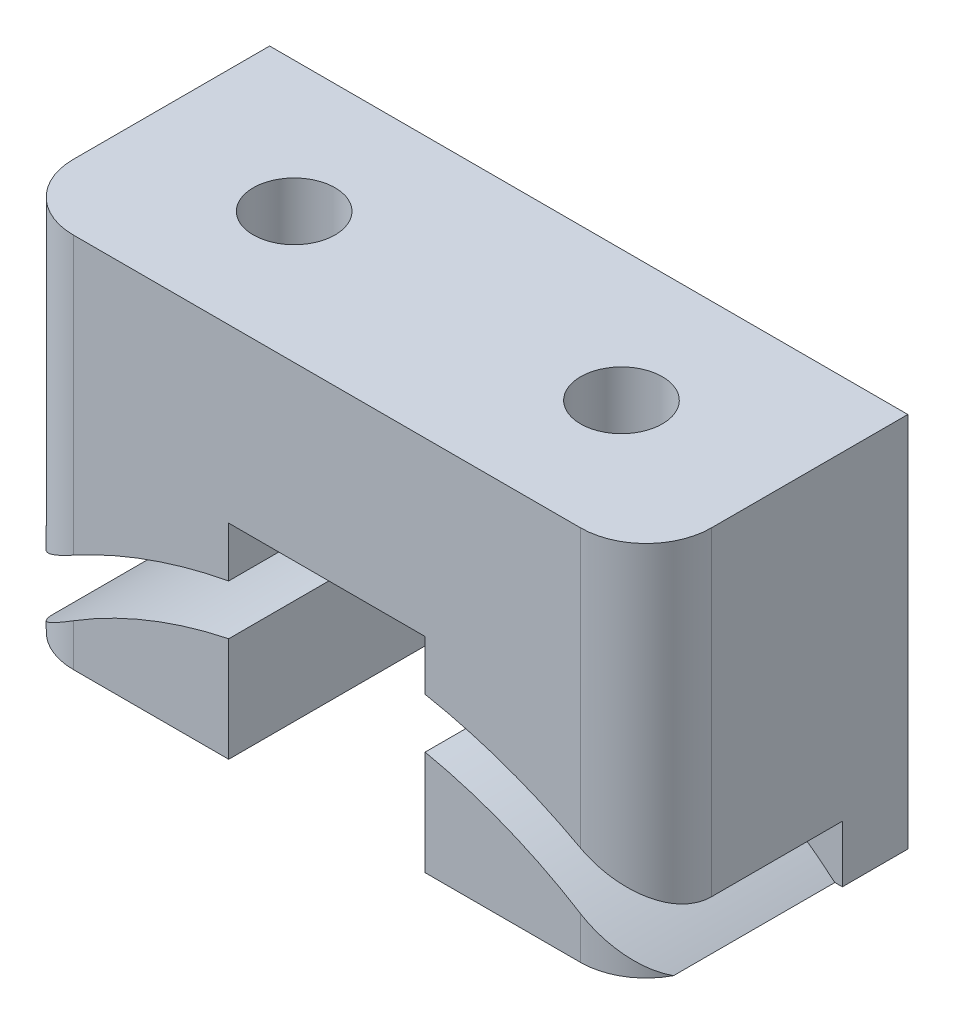
ISO-10303-21;
HEADER;
FILE_DESCRIPTION(('STEP AP214'),'2;1');
FILE_NAME('part.step','',(''),(''),'','','');
FILE_SCHEMA(('AUTOMOTIVE_DESIGN { 1 0 10303 214 1 1 1 1 }'));
ENDSEC;
DATA;
#1=APPLICATION_CONTEXT('core data for automotive mechanical design processes');
#2=APPLICATION_PROTOCOL_DEFINITION('international standard','automotive_design',2000,#1);
#3=PRODUCT_CONTEXT('',#1,'mechanical');
#4=PRODUCT('Part','Part','',(#3));
#5=PRODUCT_RELATED_PRODUCT_CATEGORY('part','',(#4));
#6=PRODUCT_DEFINITION_FORMATION('','',#4);
#7=PRODUCT_DEFINITION_CONTEXT('part definition',#1,'design');
#8=PRODUCT_DEFINITION('design','',#6,#7);
#9=PRODUCT_DEFINITION_SHAPE('','',#8);
#10=(LENGTH_UNIT() NAMED_UNIT(*) SI_UNIT(.MILLI.,.METRE.));
#11=(NAMED_UNIT(*) PLANE_ANGLE_UNIT() SI_UNIT($,.RADIAN.));
#12=(NAMED_UNIT(*) SI_UNIT($,.STERADIAN.) SOLID_ANGLE_UNIT());
#13=UNCERTAINTY_MEASURE_WITH_UNIT(LENGTH_MEASURE(1.E-05),#10,'distance_accuracy_value','');
#14=(GEOMETRIC_REPRESENTATION_CONTEXT(3) GLOBAL_UNCERTAINTY_ASSIGNED_CONTEXT((#13)) GLOBAL_UNIT_ASSIGNED_CONTEXT((#10,
#11,#12)) REPRESENTATION_CONTEXT('',''));
#15=CARTESIAN_POINT('',(0.,0.,0.));
#16=DIRECTION('',(0.,0.,1.));
#17=DIRECTION('',(1.,0.,0.));
#18=AXIS2_PLACEMENT_3D('',#15,#16,#17);
#19=CARTESIAN_POINT('',(-9.75,-5.,8.));
#20=DIRECTION('',(0.,1.,0.));
#21=DIRECTION('',(0.,0.,1.));
#22=AXIS2_PLACEMENT_3D('',#19,#20,#21);
#23=PLANE('',#22);
#24=DIRECTION('',(0.,0.,1.));
#25=VECTOR('',#24,1.);
#26=CARTESIAN_POINT('',(3.,-5.,8.));
#27=LINE('',#26,#25);
#28=CARTESIAN_POINT('',(3.,-5.,0.));
#29=VERTEX_POINT('',#28);
#30=CARTESIAN_POINT('',(3.,-5.,8.));
#31=VERTEX_POINT('',#30);
#32=EDGE_CURVE('E218',#29,#31,#27,.T.);
#33=ORIENTED_EDGE('',*,*,#32,.F.);
#34=DIRECTION('',(1.,0.,0.));
#35=VECTOR('',#34,1.);
#36=CARTESIAN_POINT('',(-9.75,-5.,0.));
#37=LINE('',#36,#35);
#38=CARTESIAN_POINT('',(9.75,-5.,0.));
#39=VERTEX_POINT('',#38);
#40=EDGE_CURVE('E285',#29,#39,#37,.T.);
#41=ORIENTED_EDGE('',*,*,#40,.T.);
#42=DIRECTION('',(0.,0.,-1.));
#43=VECTOR('',#42,1.);
#44=CARTESIAN_POINT('',(9.75,-5.,8.));
#45=LINE('',#44,#43);
#46=CARTESIAN_POINT('',(9.75,-5.,2.));
#47=VERTEX_POINT('',#46);
#48=EDGE_CURVE('E294',#47,#39,#45,.T.);
#49=ORIENTED_EDGE('',*,*,#48,.F.);
#50=DIRECTION('',(1.,0.,0.));
#51=VECTOR('',#50,1.);
#52=CARTESIAN_POINT('',(-9.75,-5.,2.));
#53=LINE('',#52,#51);
#54=CARTESIAN_POINT('',(9.52102935611481,-5.,2.));
#55=VERTEX_POINT('',#54);
#56=EDGE_CURVE('E428',#55,#47,#53,.T.);
#57=ORIENTED_EDGE('',*,*,#56,.F.);
#58=DIRECTION('',(0.,0.,1.));
#59=VECTOR('',#58,1.);
#60=CARTESIAN_POINT('',(9.52102935611481,-5.,2.));
#61=LINE('',#60,#59);
#62=CARTESIAN_POINT('',(9.52102935611481,-5.,6.92922280416462));
#63=VERTEX_POINT('',#62);
#64=EDGE_CURVE('E356',#63,#55,#61,.F.);
#65=ORIENTED_EDGE('',*,*,#64,.F.);
#66=CARTESIAN_POINT('',(7.75,-5.,6.));
#67=DIRECTION('',(0.,1.,0.));
#68=DIRECTION('',(0.,0.,1.));
#69=AXIS2_PLACEMENT_3D('',#66,#67,#68);
#70=CIRCLE('',#69,2.);
#71=CARTESIAN_POINT('',(7.75,-5.,8.));
#72=VERTEX_POINT('',#71);
#73=EDGE_CURVE('E311',#63,#72,#70,.F.);
#74=ORIENTED_EDGE('',*,*,#73,.T.);
#75=DIRECTION('',(1.,0.,0.));
#76=VECTOR('',#75,1.);
#77=CARTESIAN_POINT('',(-9.75,-5.,8.));
#78=LINE('',#77,#76);
#79=EDGE_CURVE('E288',#31,#72,#78,.T.);
#80=ORIENTED_EDGE('',*,*,#79,.F.);
#81=EDGE_LOOP('',(#33,#41,#49,#57,#65,#74,#80));
#82=FACE_BOUND('',#81,.T.);
#83=ADVANCED_FACE('F33',(#82),#23,.F.);
#84=CARTESIAN_POINT('',(0.,0.,8.));
#85=DIRECTION('',(0.,0.,-1.));
#86=DIRECTION('',(-1.,0.,0.));
#87=AXIS2_PLACEMENT_3D('',#84,#85,#86);
#88=PLANE('',#87);
#89=DIRECTION('',(0.,1.,0.));
#90=VECTOR('',#89,1.);
#91=CARTESIAN_POINT('',(3.,-11.25,8.));
#92=LINE('',#91,#90);
#93=CARTESIAN_POINT('',(3.,-1.80937805374625,8.));
#94=VERTEX_POINT('',#93);
#95=EDGE_CURVE('E182',#31,#94,#92,.T.);
#96=ORIENTED_EDGE('',*,*,#95,.F.);
#97=ORIENTED_EDGE('',*,*,#79,.T.);
#98=DIRECTION('',(0.,1.,0.));
#99=VECTOR('',#98,1.);
#100=CARTESIAN_POINT('',(7.75,0.,8.));
#101=LINE('',#100,#99);
#102=CARTESIAN_POINT('',(7.75,-3.70890317065791,8.));
#103=VERTEX_POINT('',#102);
#104=EDGE_CURVE('E304',#72,#103,#101,.T.);
#105=ORIENTED_EDGE('',*,*,#104,.T.);
#106=CARTESIAN_POINT('',(0.,-16.2,8.));
#107=DIRECTION('',(0.,0.,1.));
#108=DIRECTION('',(1.,0.,0.));
#109=AXIS2_PLACEMENT_3D('',#106,#107,#108);
#110=CIRCLE('',#109,14.7);
#111=EDGE_CURVE('E56',#103,#94,#110,.T.);
#112=ORIENTED_EDGE('',*,*,#111,.T.);
#113=EDGE_LOOP('',(#96,#97,#105,#112));
#114=FACE_BOUND('',#113,.T.);
#115=ADVANCED_FACE('F246',(#114),#88,.F.);
#116=CARTESIAN_POINT('',(3.,-0.280201006294081,8.));
#117=VERTEX_POINT('',#116);
#118=CARTESIAN_POINT('',(3.,1.25,8.));
#119=VERTEX_POINT('',#118);
#120=EDGE_CURVE('E171',#117,#119,#92,.T.);
#121=ORIENTED_EDGE('',*,*,#120,.F.);
#122=CARTESIAN_POINT('',(0.,-16.2,8.));
#123=DIRECTION('',(0.,0.,1.));
#124=DIRECTION('',(1.,0.,0.));
#125=AXIS2_PLACEMENT_3D('',#122,#123,#124);
#126=CIRCLE('',#125,16.2);
#127=CARTESIAN_POINT('',(7.75,-1.97405539164446,8.));
#128=VERTEX_POINT('',#127);
#129=EDGE_CURVE('E447',#128,#117,#126,.T.);
#130=ORIENTED_EDGE('',*,*,#129,.F.);
#131=CARTESIAN_POINT('',(7.75,6.5,8.));
#132=VERTEX_POINT('',#131);
#133=EDGE_CURVE('E303',#128,#132,#101,.T.);
#134=ORIENTED_EDGE('',*,*,#133,.T.);
#135=DIRECTION('',(-1.,0.,0.));
#136=VECTOR('',#135,1.);
#137=CARTESIAN_POINT('',(-9.75,6.5,8.));
#138=LINE('',#137,#136);
#139=CARTESIAN_POINT('',(-7.75,6.5,8.));
#140=VERTEX_POINT('',#139);
#141=EDGE_CURVE('E284',#132,#140,#138,.T.);
#142=ORIENTED_EDGE('',*,*,#141,.T.);
#143=DIRECTION('',(0.,-1.,0.));
#144=VECTOR('',#143,1.);
#145=CARTESIAN_POINT('',(-7.75,0.,8.));
#146=LINE('',#145,#144);
#147=CARTESIAN_POINT('',(-7.75,-1.97405539164446,8.));
#148=VERTEX_POINT('',#147);
#149=EDGE_CURVE('E308',#140,#148,#146,.T.);
#150=ORIENTED_EDGE('',*,*,#149,.T.);
#151=CARTESIAN_POINT('',(-3.,-0.280201006294081,8.));
#152=VERTEX_POINT('',#151);
#153=EDGE_CURVE('E421',#152,#148,#126,.T.);
#154=ORIENTED_EDGE('',*,*,#153,.F.);
#155=DIRECTION('',(0.,1.,0.));
#156=VECTOR('',#155,1.);
#157=CARTESIAN_POINT('',(-3.,-11.25,8.));
#158=LINE('',#157,#156);
#159=CARTESIAN_POINT('',(-3.,1.25,8.));
#160=VERTEX_POINT('',#159);
#161=EDGE_CURVE('E197',#152,#160,#158,.T.);
#162=ORIENTED_EDGE('',*,*,#161,.T.);
#163=DIRECTION('',(-1.,0.,0.));
#164=VECTOR('',#163,1.);
#165=CARTESIAN_POINT('',(3.,1.25,8.));
#166=LINE('',#165,#164);
#167=EDGE_CURVE('E188',#119,#160,#166,.T.);
#168=ORIENTED_EDGE('',*,*,#167,.F.);
#169=EDGE_LOOP('',(#121,#130,#134,#142,#150,#154,#162,#168));
#170=FACE_BOUND('',#169,.T.);
#171=ADVANCED_FACE('F195',(#170),#88,.F.);
#172=CARTESIAN_POINT('',(0.,0.,0.));
#173=DIRECTION('',(0.,0.,-1.));
#174=DIRECTION('',(-1.,0.,0.));
#175=AXIS2_PLACEMENT_3D('',#172,#173,#174);
#176=PLANE('',#175);
#177=ORIENTED_EDGE('',*,*,#40,.F.);
#178=DIRECTION('',(0.,1.,0.));
#179=VECTOR('',#178,1.);
#180=CARTESIAN_POINT('',(3.,-11.25,0.));
#181=LINE('',#180,#179);
#182=CARTESIAN_POINT('',(3.,1.25,0.));
#183=VERTEX_POINT('',#182);
#184=EDGE_CURVE('E202',#29,#183,#181,.T.);
#185=ORIENTED_EDGE('',*,*,#184,.T.);
#186=DIRECTION('',(-1.,0.,0.));
#187=VECTOR('',#186,1.);
#188=CARTESIAN_POINT('',(3.,1.25,0.));
#189=LINE('',#188,#187);
#190=CARTESIAN_POINT('',(-3.,1.25,0.));
#191=VERTEX_POINT('',#190);
#192=EDGE_CURVE('E191',#183,#191,#189,.T.);
#193=ORIENTED_EDGE('',*,*,#192,.T.);
#194=DIRECTION('',(0.,1.,0.));
#195=VECTOR('',#194,1.);
#196=CARTESIAN_POINT('',(-3.,-11.25,0.));
#197=LINE('',#196,#195);
#198=CARTESIAN_POINT('',(-3.,-5.,0.));
#199=VERTEX_POINT('',#198);
#200=EDGE_CURVE('E183',#199,#191,#197,.T.);
#201=ORIENTED_EDGE('',*,*,#200,.F.);
#202=CARTESIAN_POINT('',(-9.75,-5.,0.));
#203=VERTEX_POINT('',#202);
#204=EDGE_CURVE('E274',#203,#199,#37,.T.);
#205=ORIENTED_EDGE('',*,*,#204,.F.);
#206=DIRECTION('',(0.,-1.,0.));
#207=VECTOR('',#206,1.);
#208=CARTESIAN_POINT('',(-9.75,-5.,0.));
#209=LINE('',#208,#207);
#210=CARTESIAN_POINT('',(-9.75,6.5,0.));
#211=VERTEX_POINT('',#210);
#212=EDGE_CURVE('E290',#211,#203,#209,.T.);
#213=ORIENTED_EDGE('',*,*,#212,.F.);
#214=DIRECTION('',(-1.,0.,0.));
#215=VECTOR('',#214,1.);
#216=CARTESIAN_POINT('',(-9.75,6.5,0.));
#217=LINE('',#216,#215);
#218=CARTESIAN_POINT('',(9.75,6.5,0.));
#219=VERTEX_POINT('',#218);
#220=EDGE_CURVE('E409',#219,#211,#217,.T.);
#221=ORIENTED_EDGE('',*,*,#220,.F.);
#222=DIRECTION('',(0.,1.,0.));
#223=VECTOR('',#222,1.);
#224=CARTESIAN_POINT('',(9.75,-5.,0.));
#225=LINE('',#224,#223);
#226=EDGE_CURVE('E393',#39,#219,#225,.T.);
#227=ORIENTED_EDGE('',*,*,#226,.F.);
#228=EDGE_LOOP('',(#177,#185,#193,#201,#205,#213,#221,#227));
#229=FACE_BOUND('',#228,.T.);
#230=ADVANCED_FACE('F381',(#229),#176,.T.);
#231=CARTESIAN_POINT('',(0.,-16.2,2.));
#232=DIRECTION('',(0.,0.,1.));
#233=DIRECTION('',(1.,0.,0.));
#234=AXIS2_PLACEMENT_3D('',#231,#232,#233);
#235=PLANE('',#234);
#236=CARTESIAN_POINT('',(0.,-16.2,2.));
#237=DIRECTION('',(0.,0.,1.));
#238=DIRECTION('',(1.,0.,0.));
#239=AXIS2_PLACEMENT_3D('',#236,#237,#238);
#240=CIRCLE('',#239,16.2);
#241=CARTESIAN_POINT('',(9.75,-3.26255434794024,2.));
#242=VERTEX_POINT('',#241);
#243=CARTESIAN_POINT('',(3.,-0.280201006294081,2.));
#244=VERTEX_POINT('',#243);
#245=EDGE_CURVE('E445',#242,#244,#240,.T.);
#246=ORIENTED_EDGE('',*,*,#245,.T.);
#247=DIRECTION('',(0.,-1.,0.));
#248=VECTOR('',#247,1.);
#249=CARTESIAN_POINT('',(3.,-16.2,2.));
#250=LINE('',#249,#248);
#251=CARTESIAN_POINT('',(3.,-1.80937805374625,2.));
#252=VERTEX_POINT('',#251);
#253=EDGE_CURVE('E214',#244,#252,#250,.T.);
#254=ORIENTED_EDGE('',*,*,#253,.T.);
#255=CARTESIAN_POINT('',(0.,-16.2,2.));
#256=DIRECTION('',(0.,0.,1.));
#257=DIRECTION('',(1.,0.,0.));
#258=AXIS2_PLACEMENT_3D('',#255,#256,#257);
#259=CIRCLE('',#258,14.7);
#260=EDGE_CURVE('E444',#55,#252,#259,.T.);
#261=ORIENTED_EDGE('',*,*,#260,.F.);
#262=ORIENTED_EDGE('',*,*,#56,.T.);
#263=DIRECTION('',(0.,1.,0.));
#264=VECTOR('',#263,1.);
#265=CARTESIAN_POINT('',(9.75,-5.,2.));
#266=LINE('',#265,#264);
#267=EDGE_CURVE('E401',#47,#242,#266,.T.);
#268=ORIENTED_EDGE('',*,*,#267,.T.);
#269=EDGE_LOOP('',(#246,#254,#261,#262,#268));
#270=FACE_BOUND('',#269,.T.);
#271=ADVANCED_FACE('F383',(#270),#235,.T.);
#272=CARTESIAN_POINT('',(0.,-16.2,2.));
#273=DIRECTION('',(0.,0.,1.));
#274=DIRECTION('',(1.,0.,0.));
#275=AXIS2_PLACEMENT_3D('',#272,#273,#274);
#276=CYLINDRICAL_SURFACE('',#275,16.2);
#277=CARTESIAN_POINT('',(5.,-0.790911772593422,5.25));
#278=CARTESIAN_POINT('',(4.92832752241009,-0.767655915310068,5.24999741711892));
#279=CARTESIAN_POINT('',(4.85644760344739,-0.744889599337321,5.24382079121709));
#280=CARTESIAN_POINT('',(4.71429839763982,-0.700937483207522,5.21905172153236));
#281=CARTESIAN_POINT('',(4.64403063024637,-0.67975313481902,5.20044802541624));
#282=CARTESIAN_POINT('',(4.50716041966972,-0.639453722545459,5.15104583331516));
#283=CARTESIAN_POINT('',(4.44056265023773,-0.620341268587926,5.12023217887717));
#284=CARTESIAN_POINT('',(4.31330730343238,-0.584630909141602,5.0470610429256));
#285=CARTESIAN_POINT('',(4.25264777507901,-0.568032176794917,5.00470737024747));
#286=CARTESIAN_POINT('',(4.14113720626484,-0.538128548356296,4.91103757212503));
#287=CARTESIAN_POINT('',(4.09003762687463,-0.524736456258344,4.86004532528484));
#288=CARTESIAN_POINT('',(3.99712318079939,-0.500786176318442,4.74962738220938));
#289=CARTESIAN_POINT('',(3.95530673948906,-0.490227507801719,4.69020311903767));
#290=CARTESIAN_POINT('',(3.8837602641599,-0.472389810425092,4.56692663900732));
#291=CARTESIAN_POINT('',(3.85365061066989,-0.465006758624082,4.50330960002847));
#292=CARTESIAN_POINT('',(3.80447660516294,-0.453044642951162,4.37169432186705));
#293=CARTESIAN_POINT('',(3.78541068968811,-0.448465182170686,4.30369670435669));
#294=CARTESIAN_POINT('',(3.75927301986029,-0.442206869586319,4.16686067820164));
#295=CARTESIAN_POINT('',(3.75194706224651,-0.440466527397886,4.09807352662042));
#296=CARTESIAN_POINT('',(3.74873264284202,-0.439701557263308,3.96021938511541));
#297=CARTESIAN_POINT('',(3.75284342582668,-0.440676749996946,3.89115241397024));
#298=CARTESIAN_POINT('',(3.77228682930195,-0.44531978032452,3.7552658729158));
#299=CARTESIAN_POINT('',(3.78753138586014,-0.44896648793731,3.68843294596633));
#300=CARTESIAN_POINT('',(3.82864122272979,-0.458908864712245,3.55832939700728));
#301=CARTESIAN_POINT('',(3.85450646216059,-0.465204523678168,3.49505876128696));
#302=CARTESIAN_POINT('',(3.91617103005992,-0.480438523954785,3.37351679714506));
#303=CARTESIAN_POINT('',(3.95201825746357,-0.48938962137151,3.31527139329856));
#304=CARTESIAN_POINT('',(4.03244495733429,-0.509840528566483,3.20567097847126));
#305=CARTESIAN_POINT('',(4.07702494345059,-0.521340488270648,3.15431637309757));
#306=CARTESIAN_POINT('',(4.1744058645665,-0.546984002750375,3.05892476306311));
#307=CARTESIAN_POINT('',(4.22733986590104,-0.561171258947605,3.01503546789167));
#308=CARTESIAN_POINT('',(4.33920907226946,-0.591841057573526,2.93674138657054));
#309=CARTESIAN_POINT('',(4.3981450694608,-0.60832390308526,2.90233785460134));
#310=CARTESIAN_POINT('',(4.52223389696362,-0.643853658003757,2.84279565535211));
#311=CARTESIAN_POINT('',(4.58752358228262,-0.662964678858992,2.81798071538352));
#312=CARTESIAN_POINT('',(4.7208120951992,-0.702942988414325,2.77960373643822));
#313=CARTESIAN_POINT('',(4.78881145340094,-0.723810621990586,2.76604391288292));
#314=CARTESIAN_POINT('',(4.92844315592116,-0.767695873922897,2.74999503049249));
#315=CARTESIAN_POINT('',(5.00011224196507,-0.79076604402298,2.74796900285824));
#316=CARTESIAN_POINT('',(5.14249715464828,-0.837697195037619,2.75610179917648));
#317=CARTESIAN_POINT('',(5.2132127706691,-0.861558346778223,2.76626327211999));
#318=CARTESIAN_POINT('',(5.35418162770589,-0.910183760960313,2.79897407448934));
#319=CARTESIAN_POINT('',(5.42434067424899,-0.934951586906989,2.82192551459416));
#320=CARTESIAN_POINT('',(5.5597654452518,-0.983752299623215,2.87991540783506));
#321=CARTESIAN_POINT('',(5.62503053118404,-1.00778509024947,2.91495543487096));
#322=CARTESIAN_POINT('',(5.74894781616147,-1.05424173074427,2.99646046564042));
#323=CARTESIAN_POINT('',(5.80758082434799,-1.07666084640809,3.04295744695464));
#324=CARTESIAN_POINT('',(5.91610514278848,-1.11878341538606,3.1462673907349));
#325=CARTESIAN_POINT('',(5.96599835120182,-1.1384874581763,3.20307810773345));
#326=CARTESIAN_POINT('',(6.05318414517263,-1.17332123846359,3.32284140291231));
#327=CARTESIAN_POINT('',(6.090937265068,-1.18861503226053,3.38541007591244));
#328=CARTESIAN_POINT('',(6.1551946648594,-1.21484762152312,3.5169144883316));
#329=CARTESIAN_POINT('',(6.18170528384051,-1.22578887095515,3.58584661294552));
#330=CARTESIAN_POINT('',(6.22076305364249,-1.2419746376442,3.72265150156184));
#331=CARTESIAN_POINT('',(6.23419276477959,-1.24757853900921,3.79023022431834));
#332=CARTESIAN_POINT('',(6.24975168043044,-1.25407483244132,3.92689171623083));
#333=CARTESIAN_POINT('',(6.25188498162125,-1.25496893253141,3.99597393101353));
#334=CARTESIAN_POINT('',(6.24494773512751,-1.25206914400475,4.12987766507543));
#335=CARTESIAN_POINT('',(6.23644961302328,-1.24851476957946,4.19473510409048));
#336=CARTESIAN_POINT('',(6.20956576209259,-1.23732969671022,4.32199382360901));
#337=CARTESIAN_POINT('',(6.19118005921745,-1.22969900896511,4.38439511055854));
#338=CARTESIAN_POINT('',(6.14506926113926,-1.21071233114488,4.50551461555124));
#339=CARTESIAN_POINT('',(6.11728226313467,-1.19933166264306,4.56420527917721));
#340=CARTESIAN_POINT('',(6.05336290860589,-1.17342410637939,4.67607676108062));
#341=CARTESIAN_POINT('',(6.01722900994027,-1.15889663725761,4.72925655855815));
#342=CARTESIAN_POINT('',(5.93545321615522,-1.12643263749681,4.83184724934929));
#343=CARTESIAN_POINT('',(5.88938917412323,-1.10834977456257,4.88087490690233));
#344=CARTESIAN_POINT('',(5.79049004459535,-1.07012773840221,4.97061255305657));
#345=CARTESIAN_POINT('',(5.7376512871444,-1.04998745185274,5.01131800216455));
#346=CARTESIAN_POINT('',(5.62265193317097,-1.00691568013154,5.08620360939894));
#347=CARTESIAN_POINT('',(5.5600969481718,-0.983887513257275,5.11972258998934));
#348=CARTESIAN_POINT('',(5.43049411461728,-0.937154038182828,5.17564869868763));
#349=CARTESIAN_POINT('',(5.36344981551251,-0.913449273244165,5.19806449041203));
#350=CARTESIAN_POINT('',(5.24683709406694,-0.873118031730059,5.22639034920834));
#351=CARTESIAN_POINT('',(5.19796458864748,-0.856471615238173,5.23522134372731));
#352=CARTESIAN_POINT('',(5.09942807303349,-0.823442050715136,5.24702715406857));
#353=CARTESIAN_POINT('',(5.0497640390251,-0.807058910634787,5.25000179336057));
#354=CARTESIAN_POINT('',(5.,-0.790911772593422,5.25));
#355=B_SPLINE_CURVE_WITH_KNOTS('',3,(#277,#278,#279,#280,#281,#282,#283,#284,#285,#286,#287,
#288,#289,#290,#291,#292,#293,#294,#295,#296,#297,#298,#299,#300,#301,#302,#303,#304,#305,#306,
#307,#308,#309,#310,#311,#312,#313,#314,#315,#316,#317,#318,#319,#320,#321,#322,#323,#324,#325,
#326,#327,#328,#329,#330,#331,#332,#333,#334,#335,#336,#337,#338,#339,#340,#341,#342,#343,#344,
#345,#346,#347,#348,#349,#350,#351,#352,#353,#354),.UNSPECIFIED.,.T.,.F.,(4,2,2,2,2,2,2,2,2,2,2,
2,2,2,2,2,2,2,2,2,2,2,2,2,2,2,2,2,2,2,2,2,2,2,2,2,2,2,4),(0.,0.225871057128809,
0.451946911344288,0.678304318642068,0.904587105960695,1.12375101593039,1.34287772240657,
1.55414716432867,1.76538668959977,1.97198728394147,2.17857423574636,2.38354461997685,
2.58851421525196,2.79448483586868,3.00046757504255,3.21014347629524,3.4198470870168,
3.63611501303466,3.85242549845649,4.07736179393614,4.30234698887784,4.53484077146698,
4.76736483551962,5.00054540027062,5.2336752585811,5.4564705754654,5.67914010162261,
5.88545530772704,6.09169568787419,6.28729430811593,6.4828924149844,6.67980434639967,
6.876752687649,7.08483927131237,7.29303905835984,7.51589703332915,7.73858084125938,
7.89540418092543,8.05223224770319),.UNSPECIFIED.);
#356=CARTESIAN_POINT('',(5.,-0.790911772593422,5.25));
#357=VERTEX_POINT('',#356);
#358=EDGE_CURVE('E438',#357,#357,#355,.T.);
#359=ORIENTED_EDGE('',*,*,#358,.F.);
#360=EDGE_LOOP('',(#359));
#361=FACE_BOUND('',#360,.T.);
#362=DIRECTION('',(0.,0.,1.));
#363=VECTOR('',#362,1.);
#364=CARTESIAN_POINT('',(3.,-0.280201006294081,2.));
#365=LINE('',#364,#363);
#366=EDGE_CURVE('E177',#244,#117,#365,.T.);
#367=ORIENTED_EDGE('',*,*,#366,.F.);
#368=ORIENTED_EDGE('',*,*,#245,.F.);
#369=DIRECTION('',(0.,0.,1.));
#370=VECTOR('',#369,1.);
#371=CARTESIAN_POINT('',(9.75,-3.26255434794024,2.));
#372=LINE('',#371,#370);
#373=CARTESIAN_POINT('',(9.75,-3.26255434794024,6.));
#374=VERTEX_POINT('',#373);
#375=EDGE_CURVE('E375',#374,#242,#372,.F.);
#376=ORIENTED_EDGE('',*,*,#375,.F.);
#377=CARTESIAN_POINT('',(9.75,-3.26255434794024,6.));
#378=CARTESIAN_POINT('',(9.75001021150017,-3.26256440844748,6.04877362287299));
#379=CARTESIAN_POINT('',(9.74821618675418,-3.26121007021725,6.09753975509917));
#380=CARTESIAN_POINT('',(9.74109850605592,-3.25584935466432,6.1946387784566));
#381=CARTESIAN_POINT('',(9.7357769514086,-3.25184455618953,6.24297191015915));
#382=CARTESIAN_POINT('',(9.72172848404995,-3.24129376024212,6.33853544039022));
#383=CARTESIAN_POINT('',(9.71302383130515,-3.23476437535607,6.38577095095691));
#384=CARTESIAN_POINT('',(9.69235400541125,-3.21930509558161,6.47911282919326));
#385=CARTESIAN_POINT('',(9.68038850309134,-3.21037495834729,6.52521908235613));
#386=CARTESIAN_POINT('',(9.63990505374658,-3.18027009660137,6.66118565532076));
#387=CARTESIAN_POINT('',(9.60675618247775,-3.1557474418587,6.74898381473651));
#388=CARTESIAN_POINT('',(9.52969810972085,-3.09934641778879,6.91720953598377));
#389=CARTESIAN_POINT('',(9.4857722452569,-3.06745666223306,6.9976254164794));
#390=CARTESIAN_POINT('',(9.38472349736279,-2.99503370378951,7.15639754756111));
#391=CARTESIAN_POINT('',(9.32680259889006,-2.9539998008351,7.23401496153122));
#392=CARTESIAN_POINT('',(9.20209804695968,-2.86706416169659,7.37860075587701));
#393=CARTESIAN_POINT('',(9.13531189452086,-2.82116105369277,7.4455661218573));
#394=CARTESIAN_POINT('',(8.98077367706315,-2.71682668085722,7.58039160873183));
#395=CARTESIAN_POINT('',(8.8914640034554,-2.65768850618155,7.64592436142239));
#396=CARTESIAN_POINT('',(8.70459817817457,-2.53682315439183,7.76091044329486));
#397=CARTESIAN_POINT('',(8.60703445777297,-2.47509362778799,7.81034880855269));
#398=CARTESIAN_POINT('',(8.38685949987888,-2.33925758669821,7.90026807496042));
#399=CARTESIAN_POINT('',(8.26295552223399,-2.26497585091898,7.93739505866572));
#400=CARTESIAN_POINT('',(8.07307188356609,-2.15468342144274,7.97479057437902));
#401=CARTESIAN_POINT('',(8.00909046879273,-2.11809913231847,7.98420664771235));
#402=CARTESIAN_POINT('',(7.88016951631475,-2.0455516503008,7.99680787937594));
#403=CARTESIAN_POINT('',(7.81522996690803,-2.00958846500487,7.99999296154101));
#404=CARTESIAN_POINT('',(7.75,-1.97405539164446,8.));
#405=B_SPLINE_CURVE_WITH_KNOTS('',3,(#377,#378,#379,#380,#381,#382,#383,#384,#385,#386,#387,
#388,#389,#390,#391,#392,#393,#394,#395,#396,#397,#398,#399,#400,#401,#402,#403,#404),
.UNSPECIFIED.,.F.,.F.,(4,2,2,2,2,2,2,2,2,2,2,2,2,4),(0.,0.146256814789248,0.292426584442138,
0.437650444894884,0.582888970597264,0.87249175508307,1.16254516584873,1.47693348704952,
1.79141061851217,2.16665315977221,2.54224359682794,2.98738383230616,3.21005917568093,
3.43273724093421),.UNSPECIFIED.);
#406=EDGE_CURVE('E331',#374,#128,#405,.T.);
#407=ORIENTED_EDGE('',*,*,#406,.T.);
#408=ORIENTED_EDGE('',*,*,#129,.T.);
#409=EDGE_LOOP('',(#367,#368,#376,#407,#408));
#410=FACE_BOUND('',#409,.T.);
#411=ADVANCED_FACE('F269',(#361,#410),#276,.F.);
#412=CARTESIAN_POINT('',(0.,-16.2,2.));
#413=DIRECTION('',(0.,0.,1.));
#414=DIRECTION('',(1.,0.,0.));
#415=AXIS2_PLACEMENT_3D('',#412,#413,#414);
#416=CYLINDRICAL_SURFACE('',#415,14.7);
#417=ORIENTED_EDGE('',*,*,#260,.T.);
#418=DIRECTION('',(0.,0.,1.));
#419=VECTOR('',#418,1.);
#420=CARTESIAN_POINT('',(3.,-1.80937805374625,2.));
#421=LINE('',#420,#419);
#422=EDGE_CURVE('E11',#252,#94,#421,.T.);
#423=ORIENTED_EDGE('',*,*,#422,.T.);
#424=ORIENTED_EDGE('',*,*,#111,.F.);
#425=CARTESIAN_POINT('',(9.52102935611481,-5.,6.92922280416462));
#426=CARTESIAN_POINT('',(9.49261136295136,-4.9758409081193,6.98337471711131));
#427=CARTESIAN_POINT('',(9.46205463451771,-4.95005255760685,7.03558829326773));
#428=CARTESIAN_POINT('',(9.39714636156302,-4.89577847505668,7.13599377143114));
#429=CARTESIAN_POINT('',(9.36280016341099,-4.8672965511522,7.18419117520801));
#430=CARTESIAN_POINT('',(9.2551740761095,-4.77895408910065,7.32211548037069));
#431=CARTESIAN_POINT('',(9.17689793179396,-4.71584522049557,7.40593104756799));
#432=CARTESIAN_POINT('',(9.01044731882262,-4.58479390305946,7.55686758763356));
#433=CARTESIAN_POINT('',(8.92233185750779,-4.51688107853198,7.62408106025901));
#434=CARTESIAN_POINT('',(8.73763921195156,-4.37811047389455,7.74259758489486));
#435=CARTESIAN_POINT('',(8.64103707119306,-4.3072443536633,7.79385155086108));
#436=CARTESIAN_POINT('',(8.41685377246877,-4.14720883175949,7.89039482585941));
#437=CARTESIAN_POINT('',(8.28746337783901,-4.05779084097009,7.93118048825178));
#438=CARTESIAN_POINT('',(8.08871753873053,-3.92526892878545,7.97226704359235));
#439=CARTESIAN_POINT('',(8.02177975445686,-3.881416888061,7.98261346211632));
#440=CARTESIAN_POINT('',(7.88669618541092,-3.79449782508579,7.99647530392692));
#441=CARTESIAN_POINT('',(7.8185503465869,-3.75143083813629,7.99999042077954));
#442=CARTESIAN_POINT('',(7.75,-3.70890317065791,8.));
#443=B_SPLINE_CURVE_WITH_KNOTS('',3,(#425,#426,#427,#428,#429,#430,#431,#432,#433,#434,#435,
#436,#437,#438,#439,#440,#441,#442),.UNSPECIFIED.,.F.,.F.,(4,2,2,2,2,2,2,2,4),(0.,
0.197060594541268,0.393846638144657,0.784671426576186,1.17326693098939,1.56304608036927,
2.04789124876014,2.28970332226517,2.53152624256631),.UNSPECIFIED.);
#444=EDGE_CURVE('E326',#63,#103,#443,.T.);
#445=ORIENTED_EDGE('',*,*,#444,.F.);
#446=ORIENTED_EDGE('',*,*,#64,.T.);
#447=EDGE_LOOP('',(#417,#423,#424,#445,#446));
#448=FACE_BOUND('',#447,.T.);
#449=ADVANCED_FACE('F261',(#448),#416,.T.);
#450=ORIENTED_EDGE('',*,*,#204,.T.);
#451=DIRECTION('',(0.,0.,1.));
#452=VECTOR('',#451,1.);
#453=CARTESIAN_POINT('',(-3.,-5.,8.));
#454=LINE('',#453,#452);
#455=CARTESIAN_POINT('',(-3.,-5.,8.));
#456=VERTEX_POINT('',#455);
#457=EDGE_CURVE('E211',#199,#456,#454,.T.);
#458=ORIENTED_EDGE('',*,*,#457,.T.);
#459=CARTESIAN_POINT('',(-7.75,-5.,8.));
#460=VERTEX_POINT('',#459);
#461=EDGE_CURVE('E297',#460,#456,#78,.T.);
#462=ORIENTED_EDGE('',*,*,#461,.F.);
#463=CARTESIAN_POINT('',(-7.75,-5.,6.));
#464=DIRECTION('',(0.,1.,0.));
#465=DIRECTION('',(0.,0.,1.));
#466=AXIS2_PLACEMENT_3D('',#463,#464,#465);
#467=CIRCLE('',#466,2.);
#468=CARTESIAN_POINT('',(-9.52102935611481,-5.,6.92922280416462));
#469=VERTEX_POINT('',#468);
#470=EDGE_CURVE('E314',#460,#469,#467,.F.);
#471=ORIENTED_EDGE('',*,*,#470,.T.);
#472=DIRECTION('',(0.,0.,1.));
#473=VECTOR('',#472,1.);
#474=CARTESIAN_POINT('',(-9.52102935611481,-5.,2.));
#475=LINE('',#474,#473);
#476=CARTESIAN_POINT('',(-9.52102935611481,-5.,2.));
#477=VERTEX_POINT('',#476);
#478=EDGE_CURVE('E355',#477,#469,#475,.T.);
#479=ORIENTED_EDGE('',*,*,#478,.F.);
#480=CARTESIAN_POINT('',(-9.75,-5.,2.));
#481=VERTEX_POINT('',#480);
#482=EDGE_CURVE('E429',#481,#477,#53,.T.);
#483=ORIENTED_EDGE('',*,*,#482,.F.);
#484=DIRECTION('',(0.,0.,-1.));
#485=VECTOR('',#484,1.);
#486=CARTESIAN_POINT('',(-9.75,-5.,8.));
#487=LINE('',#486,#485);
#488=EDGE_CURVE('E279',#481,#203,#487,.T.);
#489=ORIENTED_EDGE('',*,*,#488,.T.);
#490=EDGE_LOOP('',(#450,#458,#462,#471,#479,#483,#489));
#491=FACE_BOUND('',#490,.T.);
#492=ADVANCED_FACE('F249',(#491),#23,.F.);
#493=ORIENTED_EDGE('',*,*,#461,.T.);
#494=CARTESIAN_POINT('',(-3.,-1.80937805374625,8.));
#495=VERTEX_POINT('',#494);
#496=EDGE_CURVE('E199',#456,#495,#158,.T.);
#497=ORIENTED_EDGE('',*,*,#496,.T.);
#498=CARTESIAN_POINT('',(-7.75,-3.70890317065791,8.));
#499=VERTEX_POINT('',#498);
#500=EDGE_CURVE('E435',#495,#499,#110,.T.);
#501=ORIENTED_EDGE('',*,*,#500,.T.);
#502=EDGE_CURVE('E307',#499,#460,#146,.T.);
#503=ORIENTED_EDGE('',*,*,#502,.T.);
#504=EDGE_LOOP('',(#493,#497,#501,#503));
#505=FACE_BOUND('',#504,.T.);
#506=ADVANCED_FACE('F256',(#505),#88,.F.);
#507=CARTESIAN_POINT('',(-7.75,0.,6.));
#508=DIRECTION('',(0.,-1.,0.));
#509=DIRECTION('',(0.,0.,-1.));
#510=AXIS2_PLACEMENT_3D('',#507,#508,#509);
#511=CYLINDRICAL_SURFACE('',#510,2.);
#512=ORIENTED_EDGE('',*,*,#502,.F.);
#513=CARTESIAN_POINT('',(-7.75,-3.70890317065791,8.));
#514=CARTESIAN_POINT('',(-7.82213500824793,-3.7536495686924,7.99999515027189));
#515=CARTESIAN_POINT('',(-7.89385585933956,-3.79902245735343,7.99609779445122));
#516=CARTESIAN_POINT('',(-8.03592615534263,-3.89061443362704,7.98074610774651));
#517=CARTESIAN_POINT('',(-8.1062757668201,-3.93683341712416,7.96929270066869));
#518=CARTESIAN_POINT('',(-8.24562287071225,-4.03008631108116,7.93893822970424));
#519=CARTESIAN_POINT('',(-8.31460542512138,-4.07712377017855,7.91997944078097));
#520=CARTESIAN_POINT('',(-8.45012698536681,-4.17119415166857,7.87481329802751));
#521=CARTESIAN_POINT('',(-8.51666605280821,-4.21822707414572,7.8486061270856));
#522=CARTESIAN_POINT('',(-8.70314528607781,-4.35232035678781,7.76333012804986));
#523=CARTESIAN_POINT('',(-8.81956320763289,-4.43886146997045,7.69543028766599));
#524=CARTESIAN_POINT('',(-9.0383479803938,-4.6061602889196,7.53570812244933));
#525=CARTESIAN_POINT('',(-9.14078751732172,-4.68694677911235,7.44401735353778));
#526=CARTESIAN_POINT('',(-9.28887179979317,-4.80650136927339,7.28003834557264));
#527=CARTESIAN_POINT('',(-9.34040361028192,-4.84875808583668,7.2155698618877));
#528=CARTESIAN_POINT('',(-9.43639330533075,-4.92842383283886,7.07846630905294));
#529=CARTESIAN_POINT('',(-9.48082618177492,-4.96581564291518,7.00580384321013));
#530=CARTESIAN_POINT('',(-9.52102935611481,-5.,6.92922280416462));
#531=B_SPLINE_CURVE_WITH_KNOTS('',3,(#513,#514,#515,#516,#517,#518,#519,#520,#521,#522,#523,
#524,#525,#526,#527,#528,#529,#530),.UNSPECIFIED.,.F.,.F.,(4,2,2,2,2,2,2,2,4),(0.,
0.254534469233234,0.509037824733567,0.765537866131259,1.02203143621258,1.50009231361199,
1.9755640126084,2.25304260352163,2.53147811140972),.UNSPECIFIED.);
#532=EDGE_CURVE('E348',#499,#469,#531,.T.);
#533=ORIENTED_EDGE('',*,*,#532,.T.);
#534=ORIENTED_EDGE('',*,*,#470,.F.);
#535=EDGE_LOOP('',(#512,#533,#534));
#536=FACE_BOUND('',#535,.T.);
#537=ADVANCED_FACE('F267',(#536),#511,.T.);
#538=CARTESIAN_POINT('',(7.75,0.,6.));
#539=DIRECTION('',(0.,1.,0.));
#540=DIRECTION('',(0.,0.,1.));
#541=AXIS2_PLACEMENT_3D('',#538,#539,#540);
#542=CYLINDRICAL_SURFACE('',#541,2.);
#543=ORIENTED_EDGE('',*,*,#73,.F.);
#544=ORIENTED_EDGE('',*,*,#444,.T.);
#545=ORIENTED_EDGE('',*,*,#104,.F.);
#546=EDGE_LOOP('',(#543,#544,#545));
#547=FACE_BOUND('',#546,.T.);
#548=ADVANCED_FACE('F455',(#547),#542,.T.);
#549=CARTESIAN_POINT('',(9.75,-5.,8.));
#550=DIRECTION('',(-1.,0.,0.));
#551=DIRECTION('',(0.,0.,1.));
#552=AXIS2_PLACEMENT_3D('',#549,#550,#551);
#553=PLANE('',#552);
#554=DIRECTION('',(0.,1.,0.));
#555=VECTOR('',#554,1.);
#556=CARTESIAN_POINT('',(9.75,-5.,6.));
#557=LINE('',#556,#555);
#558=CARTESIAN_POINT('',(9.75,6.5,6.));
#559=VERTEX_POINT('',#558);
#560=EDGE_CURVE('E323',#559,#374,#557,.F.);
#561=ORIENTED_EDGE('',*,*,#560,.T.);
#562=ORIENTED_EDGE('',*,*,#375,.T.);
#563=ORIENTED_EDGE('',*,*,#267,.F.);
#564=ORIENTED_EDGE('',*,*,#48,.T.);
#565=ORIENTED_EDGE('',*,*,#226,.T.);
#566=DIRECTION('',(0.,0.,-1.));
#567=VECTOR('',#566,1.);
#568=CARTESIAN_POINT('',(9.75,6.5,8.));
#569=LINE('',#568,#567);
#570=EDGE_CURVE('E301',#559,#219,#569,.T.);
#571=ORIENTED_EDGE('',*,*,#570,.F.);
#572=EDGE_LOOP('',(#561,#562,#563,#564,#565,#571));
#573=FACE_BOUND('',#572,.T.);
#574=ADVANCED_FACE('F365',(#573),#553,.F.);
#575=CARTESIAN_POINT('',(-9.75,6.5,8.));
#576=DIRECTION('',(0.,-1.,0.));
#577=DIRECTION('',(0.,0.,-1.));
#578=AXIS2_PLACEMENT_3D('',#575,#576,#577);
#579=PLANE('',#578);
#580=CARTESIAN_POINT('',(-5.,6.5,4.));
#581=DIRECTION('',(0.,1.,0.));
#582=DIRECTION('',(0.,0.,1.));
#583=AXIS2_PLACEMENT_3D('',#580,#581,#582);
#584=CIRCLE('',#583,1.25);
#585=CARTESIAN_POINT('',(-5.,6.5,5.25));
#586=VERTEX_POINT('',#585);
#587=EDGE_CURVE('E220',#586,#586,#584,.T.);
#588=ORIENTED_EDGE('',*,*,#587,.F.);
#589=EDGE_LOOP('',(#588));
#590=FACE_BOUND('',#589,.T.);
#591=CARTESIAN_POINT('',(5.,6.5,4.));
#592=DIRECTION('',(0.,1.,0.));
#593=DIRECTION('',(0.,0.,1.));
#594=AXIS2_PLACEMENT_3D('',#591,#592,#593);
#595=CIRCLE('',#594,1.25);
#596=CARTESIAN_POINT('',(5.,6.5,5.25));
#597=VERTEX_POINT('',#596);
#598=EDGE_CURVE('E230',#597,#597,#595,.T.);
#599=ORIENTED_EDGE('',*,*,#598,.F.);
#600=EDGE_LOOP('',(#599));
#601=FACE_BOUND('',#600,.T.);
#602=DIRECTION('',(0.,0.,-1.));
#603=VECTOR('',#602,1.);
#604=CARTESIAN_POINT('',(-9.75,6.5,8.));
#605=LINE('',#604,#603);
#606=CARTESIAN_POINT('',(-9.75,6.5,6.));
#607=VERTEX_POINT('',#606);
#608=EDGE_CURVE('E299',#607,#211,#605,.T.);
#609=ORIENTED_EDGE('',*,*,#608,.F.);
#610=CARTESIAN_POINT('',(-7.75,6.5,6.));
#611=DIRECTION('',(0.,-1.,0.));
#612=DIRECTION('',(0.,0.,-1.));
#613=AXIS2_PLACEMENT_3D('',#610,#611,#612);
#614=CIRCLE('',#613,2.);
#615=EDGE_CURVE('E321',#607,#140,#614,.F.);
#616=ORIENTED_EDGE('',*,*,#615,.T.);
#617=ORIENTED_EDGE('',*,*,#141,.F.);
#618=CARTESIAN_POINT('',(7.75,6.5,6.));
#619=DIRECTION('',(0.,-1.,0.));
#620=DIRECTION('',(0.,0.,-1.));
#621=AXIS2_PLACEMENT_3D('',#618,#619,#620);
#622=CIRCLE('',#621,2.);
#623=EDGE_CURVE('E319',#132,#559,#622,.F.);
#624=ORIENTED_EDGE('',*,*,#623,.T.);
#625=ORIENTED_EDGE('',*,*,#570,.T.);
#626=ORIENTED_EDGE('',*,*,#220,.T.);
#627=EDGE_LOOP('',(#609,#616,#617,#624,#625,#626));
#628=FACE_BOUND('',#627,.T.);
#629=ADVANCED_FACE('F417',(#590,#601,#628),#579,.F.);
#630=CARTESIAN_POINT('',(-9.75,-5.,8.));
#631=DIRECTION('',(1.,0.,0.));
#632=DIRECTION('',(0.,0.,-1.));
#633=AXIS2_PLACEMENT_3D('',#630,#631,#632);
#634=PLANE('',#633);
#635=DIRECTION('',(0.,-1.,0.));
#636=VECTOR('',#635,1.);
#637=CARTESIAN_POINT('',(-9.75,-5.,2.));
#638=LINE('',#637,#636);
#639=CARTESIAN_POINT('',(-9.75,-3.26255434794024,2.));
#640=VERTEX_POINT('',#639);
#641=EDGE_CURVE('E404',#640,#481,#638,.T.);
#642=ORIENTED_EDGE('',*,*,#641,.F.);
#643=DIRECTION('',(0.,0.,1.));
#644=VECTOR('',#643,1.);
#645=CARTESIAN_POINT('',(-9.75,-3.26255434794024,2.));
#646=LINE('',#645,#644);
#647=CARTESIAN_POINT('',(-9.75,-3.26255434794024,6.));
#648=VERTEX_POINT('',#647);
#649=EDGE_CURVE('E374',#640,#648,#646,.T.);
#650=ORIENTED_EDGE('',*,*,#649,.T.);
#651=DIRECTION('',(0.,-1.,0.));
#652=VECTOR('',#651,1.);
#653=CARTESIAN_POINT('',(-9.75,-5.,6.));
#654=LINE('',#653,#652);
#655=EDGE_CURVE('E317',#648,#607,#654,.F.);
#656=ORIENTED_EDGE('',*,*,#655,.T.);
#657=ORIENTED_EDGE('',*,*,#608,.T.);
#658=ORIENTED_EDGE('',*,*,#212,.T.);
#659=ORIENTED_EDGE('',*,*,#488,.F.);
#660=EDGE_LOOP('',(#642,#650,#656,#657,#658,#659));
#661=FACE_BOUND('',#660,.T.);
#662=ADVANCED_FACE('F363',(#661),#634,.F.);
#663=CARTESIAN_POINT('',(-7.75,-1.97405539164446,8.));
#664=CARTESIAN_POINT('',(-7.82496672513251,-2.01488607836006,7.99999814963476));
#665=CARTESIAN_POINT('',(-7.89958510277285,-2.05631437900145,7.99578536645678));
#666=CARTESIAN_POINT('',(-8.0474703246306,-2.13993723195314,7.97915380895807));
#667=CARTESIAN_POINT('',(-8.12073714303998,-2.18213179886484,7.96673487810723));
#668=CARTESIAN_POINT('',(-8.26550338281597,-2.2669984183749,7.93385197338581));
#669=CARTESIAN_POINT('',(-8.33699606720841,-2.30967159650023,7.91336120929902));
#670=CARTESIAN_POINT('',(-8.47731165346464,-2.39485845132906,7.86454763226758));
#671=CARTESIAN_POINT('',(-8.54613493752969,-2.43737215007339,7.83622594529969));
#672=CARTESIAN_POINT('',(-8.72977769221234,-2.55266347068493,7.74833890067766));
#673=CARTESIAN_POINT('',(-8.8414142374057,-2.62482904118023,7.68107394729661));
#674=CARTESIAN_POINT('',(-9.05129441682456,-2.76385893857943,7.52438162235119));
#675=CARTESIAN_POINT('',(-9.14957003156162,-2.83073575794844,7.43500866882501));
#676=CARTESIAN_POINT('',(-9.30746474905122,-2.9403603822434,7.25886904170184));
#677=CARTESIAN_POINT('',(-9.37071227719407,-2.98505789442456,7.17656943896229));
#678=CARTESIAN_POINT('',(-9.48500348344466,-3.06684951355929,7.00039444166375));
#679=CARTESIAN_POINT('',(-9.53604723451629,-3.10394366597163,6.90651911631876));
#680=CARTESIAN_POINT('',(-9.62376609467915,-3.1682635785894,6.7077195552112));
#681=CARTESIAN_POINT('',(-9.66029543059499,-3.19538902587672,6.6026960210167));
#682=CARTESIAN_POINT('',(-9.70176249659182,-3.22633091271781,6.44018619559177));
#683=CARTESIAN_POINT('',(-9.71335999512361,-3.23501763477448,6.38523007052704));
#684=CARTESIAN_POINT('',(-9.73192188845402,-3.24894461897522,6.27412634181513));
#685=CARTESIAN_POINT('',(-9.73889029255609,-3.25418786350359,6.21797981280227));
#686=CARTESIAN_POINT('',(-9.74564121905388,-3.2592703791393,6.1347008982877));
#687=CARTESIAN_POINT('',(-9.74727577470261,-3.26050165370034,6.10778469168661));
#688=CARTESIAN_POINT('',(-9.74945457361038,-3.26214326955836,6.05391417988004));
#689=CARTESIAN_POINT('',(-9.75000006494281,-3.26255455057148,6.02695995375136));
#690=CARTESIAN_POINT('',(-9.75000000000001,-3.26255434794018,6.));
#691=B_SPLINE_CURVE_WITH_KNOTS('',3,(#663,#664,#665,#666,#667,#668,#669,#670,#671,#672,#673,
#674,#675,#676,#677,#678,#679,#680,#681,#682,#683,#684,#685,#686,#687,#688,#689,#690),
.UNSPECIFIED.,.F.,.F.,(4,2,2,2,2,2,2,2,2,2,2,2,2,4),(0.,0.255958397783233,0.511921678046481,
0.768741750324559,1.02552491466809,1.47015590245104,1.91370315171596,2.25140971989508,
2.58911426894445,2.93012960230986,3.1003831029961,3.27048895255233,3.35144165681327,
3.43230153547786),.UNSPECIFIED.);
#692=EDGE_CURVE('E369',#148,#648,#691,.T.);
#693=ORIENTED_EDGE('',*,*,#692,.F.);
#694=ORIENTED_EDGE('',*,*,#149,.F.);
#695=ORIENTED_EDGE('',*,*,#615,.F.);
#696=ORIENTED_EDGE('',*,*,#655,.F.);
#697=EDGE_LOOP('',(#693,#694,#695,#696));
#698=FACE_BOUND('',#697,.T.);
#699=ADVANCED_FACE('F359',(#698),#511,.T.);
#700=ORIENTED_EDGE('',*,*,#406,.F.);
#701=ORIENTED_EDGE('',*,*,#560,.F.);
#702=ORIENTED_EDGE('',*,*,#623,.F.);
#703=ORIENTED_EDGE('',*,*,#133,.F.);
#704=EDGE_LOOP('',(#700,#701,#702,#703));
#705=FACE_BOUND('',#704,.T.);
#706=ADVANCED_FACE('F35',(#705),#542,.T.);
#707=DIRECTION('',(0.,-1.,0.));
#708=VECTOR('',#707,1.);
#709=CARTESIAN_POINT('',(-3.,-16.2,2.));
#710=LINE('',#709,#708);
#711=CARTESIAN_POINT('',(-3.,-0.280201006294081,2.));
#712=VERTEX_POINT('',#711);
#713=CARTESIAN_POINT('',(-3.,-1.80937805374625,2.));
#714=VERTEX_POINT('',#713);
#715=EDGE_CURVE('E49',#712,#714,#710,.T.);
#716=ORIENTED_EDGE('',*,*,#715,.F.);
#717=EDGE_CURVE('E446',#712,#640,#240,.T.);
#718=ORIENTED_EDGE('',*,*,#717,.T.);
#719=ORIENTED_EDGE('',*,*,#641,.T.);
#720=ORIENTED_EDGE('',*,*,#482,.T.);
#721=EDGE_CURVE('E440',#714,#477,#259,.T.);
#722=ORIENTED_EDGE('',*,*,#721,.F.);
#723=EDGE_LOOP('',(#716,#718,#719,#720,#722));
#724=FACE_BOUND('',#723,.T.);
#725=ADVANCED_FACE('F345',(#724),#235,.T.);
#726=CARTESIAN_POINT('',(-5.,-0.790911772593423,5.25));
#727=CARTESIAN_POINT('',(-5.07403915287312,-0.814937163671935,5.24999705192444));
#728=CARTESIAN_POINT('',(-5.14796242375935,-0.839519387763754,5.24340420399626));
#729=CARTESIAN_POINT('',(-5.29345605744923,-0.889047972742492,5.2173171858424));
#730=CARTESIAN_POINT('',(-5.36502272031074,-0.913994825004155,5.19780365719142));
#731=CARTESIAN_POINT('',(-5.50373677743795,-0.963389510850923,5.14639278013857));
#732=CARTESIAN_POINT('',(-5.57088531453295,-0.987837472345552,5.1144986490515));
#733=CARTESIAN_POINT('',(-5.69883226409021,-1.03530512443347,5.03906056101345));
#734=CARTESIAN_POINT('',(-5.759632654832,-1.05832525906868,4.99552024853034));
#735=CARTESIAN_POINT('',(-5.87229462182024,-1.10166369184967,4.89836840503563));
#736=CARTESIAN_POINT('',(-5.92425718004794,-1.12201180672925,4.84488768623822));
#737=CARTESIAN_POINT('',(-6.01829499114923,-1.15929885193669,4.72879940651034));
#738=CARTESIAN_POINT('',(-6.06037340857457,-1.17623887316544,4.66619477716345));
#739=CARTESIAN_POINT('',(-6.13074617501757,-1.20482364089975,4.53755556440691));
#740=CARTESIAN_POINT('',(-6.1597097703551,-1.21672276028878,4.47194430293699));
#741=CARTESIAN_POINT('',(-6.20609247904446,-1.23587443501094,4.3361273059097));
#742=CARTESIAN_POINT('',(-6.22351800321002,-1.24312957057198,4.26592414558251));
#743=CARTESIAN_POINT('',(-6.24519721072531,-1.25216943073947,4.12837474303269));
#744=CARTESIAN_POINT('',(-6.25030774058789,-1.25430991950754,4.06118592608072));
#745=CARTESIAN_POINT('',(-6.24966376180525,-1.25404053639761,3.92687721897854));
#746=CARTESIAN_POINT('',(-6.24391170498903,-1.25163169136421,3.85975731669473));
#747=CARTESIAN_POINT('',(-6.22216074394366,-1.24256555773808,3.72976586389758));
#748=CARTESIAN_POINT('',(-6.2065006580159,-1.23604877183415,3.66682713437958));
#749=CARTESIAN_POINT('',(-6.16586310471327,-1.21925862780268,3.54457272769038));
#750=CARTESIAN_POINT('',(-6.14088478220237,-1.20898492490397,3.48525738361941));
#751=CARTESIAN_POINT('',(-6.08167182750927,-1.18486386524665,3.37008314649136));
#752=CARTESIAN_POINT('',(-6.04719922225232,-1.17092511919061,3.31436614276228));
#753=CARTESIAN_POINT('',(-5.97045125054845,-1.14027169567622,3.20946090957383));
#754=CARTESIAN_POINT('',(-5.92817373735763,-1.12355625461354,3.16027448276762));
#755=CARTESIAN_POINT('',(-5.83397460023272,-1.08684493680984,3.06635265370385));
#756=CARTESIAN_POINT('',(-5.78159940320923,-1.0667050411336,3.02212858273792));
#757=CARTESIAN_POINT('',(-5.67078078069622,-1.02483099047029,2.94302699969273));
#758=CARTESIAN_POINT('',(-5.61233539739787,-1.00309632179086,2.9081525161923));
#759=CARTESIAN_POINT('',(-5.48689977399282,-0.9573406873308,2.84647425793426));
#760=CARTESIAN_POINT('',(-5.41960139805808,-0.933262750105087,2.82033789544244));
#761=CARTESIAN_POINT('',(-5.28156091669729,-0.884959585512255,2.78000141828509));
#762=CARTESIAN_POINT('',(-5.21081810524426,-0.860734328846268,2.76580376175811));
#763=CARTESIAN_POINT('',(-5.06563795416929,-0.812169234739212,2.74952797537142));
#764=CARTESIAN_POINT('',(-4.99115309927122,-0.78784684417031,2.74781720514019));
#765=CARTESIAN_POINT('',(-4.84263585232652,-0.740538444974875,2.75771413648728));
#766=CARTESIAN_POINT('',(-4.76860344370565,-0.717552387129342,2.76932134721882));
#767=CARTESIAN_POINT('',(-4.6242649667126,-0.67383551799407,2.80552044492703));
#768=CARTESIAN_POINT('',(-4.55392142195412,-0.653077815353544,2.82992972938333));
#769=CARTESIAN_POINT('',(-4.41814610444571,-0.613949241112817,2.89117693583595));
#770=CARTESIAN_POINT('',(-4.35271327476435,-0.595577855280881,2.92801217396637));
#771=CARTESIAN_POINT('',(-4.23141663550028,-0.56225962246778,3.0115703459422));
#772=CARTESIAN_POINT('',(-4.17528093786999,-0.547207953735472,3.05785668612703));
#773=CARTESIAN_POINT('',(-4.07156599885672,-0.519909708267937,3.15988229529659));
#774=CARTESIAN_POINT('',(-4.02398480905072,-0.507662492600287,3.21561940608635));
#775=CARTESIAN_POINT('',(-3.94073411709354,-0.486553729134235,3.33260964617654));
#776=CARTESIAN_POINT('',(-3.90467373592105,-0.477579155266502,3.39356444239572));
#777=CARTESIAN_POINT('',(-3.84326668229056,-0.462455503307043,3.52097360948204));
#778=CARTESIAN_POINT('',(-3.81791829796595,-0.45630597373594,3.58742709958063));
#779=CARTESIAN_POINT('',(-3.77932937455641,-0.446998518043957,3.72207700487415));
#780=CARTESIAN_POINT('',(-3.76579106662528,-0.443766942459105,3.7901831330883));
#781=CARTESIAN_POINT('',(-3.75017010142523,-0.440041540640734,3.92776885405523));
#782=CARTESIAN_POINT('',(-3.74808650209507,-0.439547489266981,3.99724833338881));
#783=CARTESIAN_POINT('',(-3.75540116976138,-0.441288930556257,4.13476230514793));
#784=CARTESIAN_POINT('',(-3.76466807906531,-0.443493195845542,4.20280423163705));
#785=CARTESIAN_POINT('',(-3.79415593400937,-0.450568006093347,4.33632451074739));
#786=CARTESIAN_POINT('',(-3.81437669488861,-0.455438506079944,4.40180290658824));
#787=CARTESIAN_POINT('',(-3.86514962003259,-0.467826028394468,4.52846688655964));
#788=CARTESIAN_POINT('',(-3.89571736144663,-0.475347041717605,4.58964582926232));
#789=CARTESIAN_POINT('',(-3.96618915845172,-0.492974258583048,4.70594525991374));
#790=CARTESIAN_POINT('',(-4.00609321233985,-0.503080461653826,4.7610657489675));
#791=CARTESIAN_POINT('',(-4.09461139877665,-0.525936368278539,4.86456580455068));
#792=CARTESIAN_POINT('',(-4.14334114899556,-0.538721565755195,4.91283855652556));
#793=CARTESIAN_POINT('',(-4.24761934455687,-0.566681744190995,5.00053330170045));
#794=CARTESIAN_POINT('',(-4.30317017897144,-0.581857562990374,5.03995218009265));
#795=CARTESIAN_POINT('',(-4.42108427605529,-0.614819105215341,5.11004248203299));
#796=CARTESIAN_POINT('',(-4.48359581399878,-0.632666522209272,5.14043486123775));
#797=CARTESIAN_POINT('',(-4.61221488649993,-0.670288156309526,5.1903250405683));
#798=CARTESIAN_POINT('',(-4.67831897067673,-0.690060538583683,5.20983309824989));
#799=CARTESIAN_POINT('',(-4.78732079172998,-0.723453170064389,5.23252327085071));
#800=CARTESIAN_POINT('',(-4.82968691554665,-0.736620353930499,5.23908018340187));
#801=CARTESIAN_POINT('',(-4.91471482775412,-0.763434101372857,5.24781939864702));
#802=CARTESIAN_POINT('',(-4.95737661642685,-0.777080665406267,5.25000169716901));
#803=CARTESIAN_POINT('',(-5.,-0.790911772593423,5.25));
#804=B_SPLINE_CURVE_WITH_KNOTS('',3,(#726,#727,#728,#729,#730,#731,#732,#733,#734,#735,#736,
#737,#738,#739,#740,#741,#742,#743,#744,#745,#746,#747,#748,#749,#750,#751,#752,#753,#754,#755,
#756,#757,#758,#759,#760,#761,#762,#763,#764,#765,#766,#767,#768,#769,#770,#771,#772,#773,#774,
#775,#776,#777,#778,#779,#780,#781,#782,#783,#784,#785,#786,#787,#788,#789,#790,#791,#792,#793,
#794,#795,#796,#797,#798,#799,#800,#801,#802,#803),.UNSPECIFIED.,.T.,.F.,(4,2,2,2,2,2,2,2,2,2,2,
2,2,2,2,2,2,2,2,2,2,2,2,2,2,2,2,2,2,2,2,2,2,2,2,2,2,2,4),(0.,0.233354897810898,
0.467060213388502,0.700704837190166,0.934276431377529,1.16496777964985,1.39558516774701,
1.61253168069241,1.82935755186396,2.03059619770338,2.23178942675661,2.42644917725572,
2.62112679610689,2.82121526288875,3.02135884632303,3.2347723155759,3.44825483180024,
3.67553693536207,3.90286582407829,4.1368566594758,4.37083887119684,4.60157096513467,
4.83225325541595,5.05403038352637,5.27575693425452,5.48887142421893,5.70195184381575,
5.90949019015423,6.1170114678125,6.32215365964603,6.52729239141106,6.73274133877828,
6.93819024867233,7.14655601265743,7.35499496565791,7.56933124462291,7.78346518703734,
7.91780445817206,8.05214385742359),.UNSPECIFIED.);
#805=CARTESIAN_POINT('',(-5.,-0.790911772593423,5.25));
#806=VERTEX_POINT('',#805);
#807=EDGE_CURVE('E223',#806,#806,#804,.T.);
#808=ORIENTED_EDGE('',*,*,#807,.F.);
#809=EDGE_LOOP('',(#808));
#810=FACE_BOUND('',#809,.T.);
#811=ORIENTED_EDGE('',*,*,#717,.F.);
#812=DIRECTION('',(0.,0.,1.));
#813=VECTOR('',#812,1.);
#814=CARTESIAN_POINT('',(-3.,-0.280201006294081,2.));
#815=LINE('',#814,#813);
#816=EDGE_CURVE('E208',#712,#152,#815,.T.);
#817=ORIENTED_EDGE('',*,*,#816,.T.);
#818=ORIENTED_EDGE('',*,*,#153,.T.);
#819=ORIENTED_EDGE('',*,*,#692,.T.);
#820=ORIENTED_EDGE('',*,*,#649,.F.);
#821=EDGE_LOOP('',(#811,#817,#818,#819,#820));
#822=FACE_BOUND('',#821,.T.);
#823=ADVANCED_FACE('F342',(#810,#822),#276,.F.);
#824=DIRECTION('',(0.,0.,1.));
#825=VECTOR('',#824,1.);
#826=CARTESIAN_POINT('',(-3.,-1.80937805374625,2.));
#827=LINE('',#826,#825);
#828=EDGE_CURVE('E42',#714,#495,#827,.T.);
#829=ORIENTED_EDGE('',*,*,#828,.F.);
#830=ORIENTED_EDGE('',*,*,#721,.T.);
#831=ORIENTED_EDGE('',*,*,#478,.T.);
#832=ORIENTED_EDGE('',*,*,#532,.F.);
#833=ORIENTED_EDGE('',*,*,#500,.F.);
#834=EDGE_LOOP('',(#829,#830,#831,#832,#833));
#835=FACE_BOUND('',#834,.T.);
#836=ADVANCED_FACE('F271',(#835),#416,.T.);
#837=CARTESIAN_POINT('',(5.,-5.18534330648956,4.));
#838=DIRECTION('',(0.,1.,0.));
#839=DIRECTION('',(0.,0.,1.));
#840=AXIS2_PLACEMENT_3D('',#837,#838,#839);
#841=CYLINDRICAL_SURFACE('',#840,1.25);
#842=ORIENTED_EDGE('',*,*,#598,.T.);
#843=EDGE_LOOP('',(#842));
#844=FACE_BOUND('',#843,.T.);
#845=ORIENTED_EDGE('',*,*,#358,.T.);
#846=EDGE_LOOP('',(#845));
#847=FACE_BOUND('',#846,.T.);
#848=ADVANCED_FACE('F341',(#844,#847),#841,.F.);
#849=CARTESIAN_POINT('',(-5.,-5.18534330648956,4.));
#850=DIRECTION('',(0.,1.,0.));
#851=DIRECTION('',(0.,0.,1.));
#852=AXIS2_PLACEMENT_3D('',#849,#850,#851);
#853=CYLINDRICAL_SURFACE('',#852,1.25);
#854=ORIENTED_EDGE('',*,*,#587,.T.);
#855=EDGE_LOOP('',(#854));
#856=FACE_BOUND('',#855,.T.);
#857=ORIENTED_EDGE('',*,*,#807,.T.);
#858=EDGE_LOOP('',(#857));
#859=FACE_BOUND('',#858,.T.);
#860=ADVANCED_FACE('F232',(#856,#859),#853,.F.);
#861=CARTESIAN_POINT('',(3.,-11.25,8.));
#862=DIRECTION('',(-1.,0.,0.));
#863=DIRECTION('',(0.,0.,1.));
#864=AXIS2_PLACEMENT_3D('',#861,#862,#863);
#865=PLANE('',#864);
#866=ORIENTED_EDGE('',*,*,#32,.T.);
#867=ORIENTED_EDGE('',*,*,#95,.T.);
#868=ORIENTED_EDGE('',*,*,#422,.F.);
#869=ORIENTED_EDGE('',*,*,#253,.F.);
#870=ORIENTED_EDGE('',*,*,#366,.T.);
#871=ORIENTED_EDGE('',*,*,#120,.T.);
#872=DIRECTION('',(0.,0.,-1.));
#873=VECTOR('',#872,1.);
#874=CARTESIAN_POINT('',(3.,1.25,8.));
#875=LINE('',#874,#873);
#876=EDGE_CURVE('E174',#119,#183,#875,.T.);
#877=ORIENTED_EDGE('',*,*,#876,.T.);
#878=ORIENTED_EDGE('',*,*,#184,.F.);
#879=EDGE_LOOP('',(#866,#867,#868,#869,#870,#871,#877,#878));
#880=FACE_BOUND('',#879,.T.);
#881=ADVANCED_FACE('F173',(#880),#865,.T.);
#882=CARTESIAN_POINT('',(-3.,-11.25,8.));
#883=DIRECTION('',(-1.,0.,0.));
#884=DIRECTION('',(0.,0.,1.));
#885=AXIS2_PLACEMENT_3D('',#882,#883,#884);
#886=PLANE('',#885);
#887=ORIENTED_EDGE('',*,*,#200,.T.);
#888=DIRECTION('',(0.,0.,-1.));
#889=VECTOR('',#888,1.);
#890=CARTESIAN_POINT('',(-3.,1.25,8.));
#891=LINE('',#890,#889);
#892=EDGE_CURVE('E192',#160,#191,#891,.T.);
#893=ORIENTED_EDGE('',*,*,#892,.F.);
#894=ORIENTED_EDGE('',*,*,#161,.F.);
#895=ORIENTED_EDGE('',*,*,#816,.F.);
#896=ORIENTED_EDGE('',*,*,#715,.T.);
#897=ORIENTED_EDGE('',*,*,#828,.T.);
#898=ORIENTED_EDGE('',*,*,#496,.F.);
#899=ORIENTED_EDGE('',*,*,#457,.F.);
#900=EDGE_LOOP('',(#887,#893,#894,#895,#896,#897,#898,#899));
#901=FACE_BOUND('',#900,.T.);
#902=ADVANCED_FACE('F239',(#901),#886,.F.);
#903=CARTESIAN_POINT('',(3.,1.25,8.));
#904=DIRECTION('',(0.,-1.,0.));
#905=DIRECTION('',(0.,0.,-1.));
#906=AXIS2_PLACEMENT_3D('',#903,#904,#905);
#907=PLANE('',#906);
#908=ORIENTED_EDGE('',*,*,#192,.F.);
#909=ORIENTED_EDGE('',*,*,#876,.F.);
#910=ORIENTED_EDGE('',*,*,#167,.T.);
#911=ORIENTED_EDGE('',*,*,#892,.T.);
#912=EDGE_LOOP('',(#908,#909,#910,#911));
#913=FACE_BOUND('',#912,.T.);
#914=ADVANCED_FACE('F186',(#913),#907,.T.);
#915=CLOSED_SHELL('',(#83,#115,#171,#230,#271,#411,#449,#492,#506,#537,#548,#574,#629,#662,#699,
#706,#725,#823,#836,#848,#860,#881,#902,#914));
#916=MANIFOLD_SOLID_BREP('B2',#915);
#917=ADVANCED_BREP_SHAPE_REPRESENTATION('',(#18,#916),#14);
#918=SHAPE_DEFINITION_REPRESENTATION(#9,#917);
ENDSEC;
END-ISO-10303-21;
